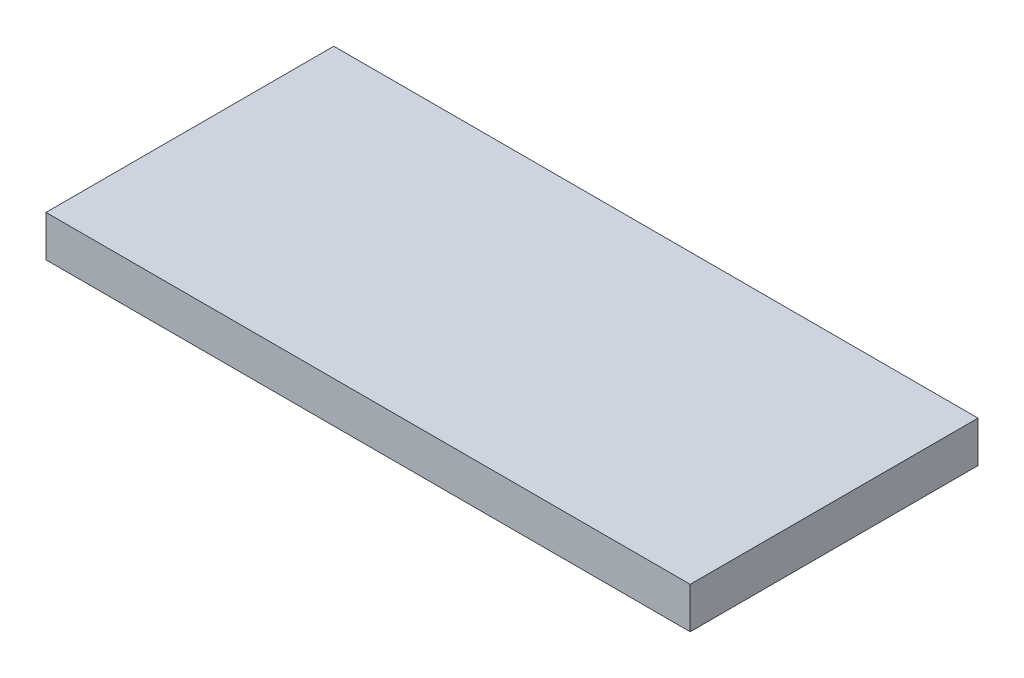
ISO-10303-21;
HEADER;
FILE_DESCRIPTION(('STEP AP214'),'2;1');
FILE_NAME('part.step','',(''),(''),'','','');
FILE_SCHEMA(('AUTOMOTIVE_DESIGN { 1 0 10303 214 1 1 1 1 }'));
ENDSEC;
DATA;
#1=APPLICATION_CONTEXT('core data for automotive mechanical design processes');
#2=APPLICATION_PROTOCOL_DEFINITION('international standard','automotive_design',2000,#1);
#3=PRODUCT_CONTEXT('',#1,'mechanical');
#4=PRODUCT('Part','Part','',(#3));
#5=PRODUCT_RELATED_PRODUCT_CATEGORY('part','',(#4));
#6=PRODUCT_DEFINITION_FORMATION('','',#4);
#7=PRODUCT_DEFINITION_CONTEXT('part definition',#1,'design');
#8=PRODUCT_DEFINITION('design','',#6,#7);
#9=PRODUCT_DEFINITION_SHAPE('','',#8);
#10=(LENGTH_UNIT() NAMED_UNIT(*) SI_UNIT(.MILLI.,.METRE.));
#11=(NAMED_UNIT(*) PLANE_ANGLE_UNIT() SI_UNIT($,.RADIAN.));
#12=(NAMED_UNIT(*) SI_UNIT($,.STERADIAN.) SOLID_ANGLE_UNIT());
#13=UNCERTAINTY_MEASURE_WITH_UNIT(LENGTH_MEASURE(1.E-05),#10,'distance_accuracy_value','');
#14=(GEOMETRIC_REPRESENTATION_CONTEXT(3) GLOBAL_UNCERTAINTY_ASSIGNED_CONTEXT((#13)) GLOBAL_UNIT_ASSIGNED_CONTEXT((#10,
#11,#12)) REPRESENTATION_CONTEXT('',''));
#15=CARTESIAN_POINT('',(0.,0.,0.));
#16=DIRECTION('',(0.,0.,1.));
#17=DIRECTION('',(1.,0.,0.));
#18=AXIS2_PLACEMENT_3D('',#15,#16,#17);
#19=CARTESIAN_POINT('',(-47.,6.00000000000001,-21.));
#20=DIRECTION('',(0.,0.,-1.));
#21=DIRECTION('',(-1.,0.,0.));
#22=AXIS2_PLACEMENT_3D('',#19,#20,#21);
#23=PLANE('',#22);
#24=DIRECTION('',(1.,0.,0.));
#25=VECTOR('',#24,1.);
#26=CARTESIAN_POINT('',(-47.,0.,-21.));
#27=LINE('',#26,#25);
#28=CARTESIAN_POINT('',(-47.,0.,-21.));
#29=VERTEX_POINT('',#28);
#30=CARTESIAN_POINT('',(47.,0.,-21.));
#31=VERTEX_POINT('',#30);
#32=EDGE_CURVE('E103',#29,#31,#27,.T.);
#33=ORIENTED_EDGE('',*,*,#32,.F.);
#34=DIRECTION('',(0.,-1.,0.));
#35=VECTOR('',#34,1.);
#36=CARTESIAN_POINT('',(-47.,6.00000000000001,-21.));
#37=LINE('',#36,#35);
#38=CARTESIAN_POINT('',(-47.,6.00000000000001,-21.));
#39=VERTEX_POINT('',#38);
#40=EDGE_CURVE('E11',#39,#29,#37,.T.);
#41=ORIENTED_EDGE('',*,*,#40,.F.);
#42=DIRECTION('',(1.,0.,0.));
#43=VECTOR('',#42,1.);
#44=CARTESIAN_POINT('',(-47.,6.00000000000001,-21.));
#45=LINE('',#44,#43);
#46=CARTESIAN_POINT('',(47.,6.00000000000001,-21.));
#47=VERTEX_POINT('',#46);
#48=EDGE_CURVE('E98',#39,#47,#45,.T.);
#49=ORIENTED_EDGE('',*,*,#48,.T.);
#50=DIRECTION('',(0.,-1.,0.));
#51=VECTOR('',#50,1.);
#52=CARTESIAN_POINT('',(47.,6.00000000000001,-21.));
#53=LINE('',#52,#51);
#54=EDGE_CURVE('E41',#47,#31,#53,.T.);
#55=ORIENTED_EDGE('',*,*,#54,.T.);
#56=EDGE_LOOP('',(#33,#41,#49,#55));
#57=FACE_BOUND('',#56,.T.);
#58=ADVANCED_FACE('F38',(#57),#23,.T.);
#59=CARTESIAN_POINT('',(-47.,6.00000000000001,-21.));
#60=DIRECTION('',(1.,0.,0.));
#61=DIRECTION('',(0.,0.,-1.));
#62=AXIS2_PLACEMENT_3D('',#59,#60,#61);
#63=PLANE('',#62);
#64=DIRECTION('',(0.,0.,1.));
#65=VECTOR('',#64,1.);
#66=CARTESIAN_POINT('',(-47.,0.,-21.));
#67=LINE('',#66,#65);
#68=CARTESIAN_POINT('',(-47.,0.,21.));
#69=VERTEX_POINT('',#68);
#70=EDGE_CURVE('E71',#29,#69,#67,.T.);
#71=ORIENTED_EDGE('',*,*,#70,.T.);
#72=DIRECTION('',(0.,-1.,0.));
#73=VECTOR('',#72,1.);
#74=CARTESIAN_POINT('',(-47.,6.00000000000001,21.));
#75=LINE('',#74,#73);
#76=CARTESIAN_POINT('',(-47.,6.00000000000001,21.));
#77=VERTEX_POINT('',#76);
#78=EDGE_CURVE('E47',#77,#69,#75,.T.);
#79=ORIENTED_EDGE('',*,*,#78,.F.);
#80=DIRECTION('',(0.,0.,1.));
#81=VECTOR('',#80,1.);
#82=CARTESIAN_POINT('',(-47.,6.00000000000001,-21.));
#83=LINE('',#82,#81);
#84=EDGE_CURVE('E88',#39,#77,#83,.T.);
#85=ORIENTED_EDGE('',*,*,#84,.F.);
#86=ORIENTED_EDGE('',*,*,#40,.T.);
#87=EDGE_LOOP('',(#71,#79,#85,#86));
#88=FACE_BOUND('',#87,.T.);
#89=ADVANCED_FACE('F113',(#88),#63,.F.);
#90=CARTESIAN_POINT('',(-47.,6.00000000000001,21.));
#91=DIRECTION('',(0.,0.,-1.));
#92=DIRECTION('',(-1.,0.,0.));
#93=AXIS2_PLACEMENT_3D('',#90,#91,#92);
#94=PLANE('',#93);
#95=DIRECTION('',(1.,0.,0.));
#96=VECTOR('',#95,1.);
#97=CARTESIAN_POINT('',(-47.,0.,21.));
#98=LINE('',#97,#96);
#99=CARTESIAN_POINT('',(47.,0.,21.));
#100=VERTEX_POINT('',#99);
#101=EDGE_CURVE('E95',#69,#100,#98,.T.);
#102=ORIENTED_EDGE('',*,*,#101,.T.);
#103=DIRECTION('',(0.,-1.,0.));
#104=VECTOR('',#103,1.);
#105=CARTESIAN_POINT('',(47.,6.00000000000001,21.));
#106=LINE('',#105,#104);
#107=CARTESIAN_POINT('',(47.,6.00000000000001,21.));
#108=VERTEX_POINT('',#107);
#109=EDGE_CURVE('E92',#108,#100,#106,.T.);
#110=ORIENTED_EDGE('',*,*,#109,.F.);
#111=DIRECTION('',(1.,0.,0.));
#112=VECTOR('',#111,1.);
#113=CARTESIAN_POINT('',(-47.,6.00000000000001,21.));
#114=LINE('',#113,#112);
#115=EDGE_CURVE('E83',#77,#108,#114,.T.);
#116=ORIENTED_EDGE('',*,*,#115,.F.);
#117=ORIENTED_EDGE('',*,*,#78,.T.);
#118=EDGE_LOOP('',(#102,#110,#116,#117));
#119=FACE_BOUND('',#118,.T.);
#120=ADVANCED_FACE('F93',(#119),#94,.F.);
#121=CARTESIAN_POINT('',(47.,6.00000000000001,-21.));
#122=DIRECTION('',(1.,0.,0.));
#123=DIRECTION('',(0.,0.,-1.));
#124=AXIS2_PLACEMENT_3D('',#121,#122,#123);
#125=PLANE('',#124);
#126=DIRECTION('',(0.,0.,1.));
#127=VECTOR('',#126,1.);
#128=CARTESIAN_POINT('',(47.,0.,-21.));
#129=LINE('',#128,#127);
#130=EDGE_CURVE('E106',#31,#100,#129,.T.);
#131=ORIENTED_EDGE('',*,*,#130,.F.);
#132=ORIENTED_EDGE('',*,*,#54,.F.);
#133=DIRECTION('',(0.,0.,1.));
#134=VECTOR('',#133,1.);
#135=CARTESIAN_POINT('',(47.,6.00000000000001,-21.));
#136=LINE('',#135,#134);
#137=EDGE_CURVE('E87',#47,#108,#136,.T.);
#138=ORIENTED_EDGE('',*,*,#137,.T.);
#139=ORIENTED_EDGE('',*,*,#109,.T.);
#140=EDGE_LOOP('',(#131,#132,#138,#139));
#141=FACE_BOUND('',#140,.T.);
#142=ADVANCED_FACE('F97',(#141),#125,.T.);
#143=CARTESIAN_POINT('',(0.,6.00000000000001,0.));
#144=DIRECTION('',(0.,-1.,0.));
#145=DIRECTION('',(0.,0.,-1.));
#146=AXIS2_PLACEMENT_3D('',#143,#144,#145);
#147=PLANE('',#146);
#148=ORIENTED_EDGE('',*,*,#48,.F.);
#149=ORIENTED_EDGE('',*,*,#84,.T.);
#150=ORIENTED_EDGE('',*,*,#115,.T.);
#151=ORIENTED_EDGE('',*,*,#137,.F.);
#152=EDGE_LOOP('',(#148,#149,#150,#151));
#153=FACE_BOUND('',#152,.T.);
#154=ADVANCED_FACE('F86',(#153),#147,.F.);
#155=CARTESIAN_POINT('',(0.,0.,0.));
#156=DIRECTION('',(0.,-1.,0.));
#157=DIRECTION('',(0.,0.,-1.));
#158=AXIS2_PLACEMENT_3D('',#155,#156,#157);
#159=PLANE('',#158);
#160=ORIENTED_EDGE('',*,*,#32,.T.);
#161=ORIENTED_EDGE('',*,*,#130,.T.);
#162=ORIENTED_EDGE('',*,*,#101,.F.);
#163=ORIENTED_EDGE('',*,*,#70,.F.);
#164=EDGE_LOOP('',(#160,#161,#162,#163));
#165=FACE_BOUND('',#164,.T.);
#166=ADVANCED_FACE('F111',(#165),#159,.T.);
#167=CLOSED_SHELL('',(#58,#89,#120,#142,#154,#166));
#168=MANIFOLD_SOLID_BREP('B2',#167);
#169=ADVANCED_BREP_SHAPE_REPRESENTATION('',(#18,#168),#14);
#170=SHAPE_DEFINITION_REPRESENTATION(#9,#169);
ENDSEC;
END-ISO-10303-21;
